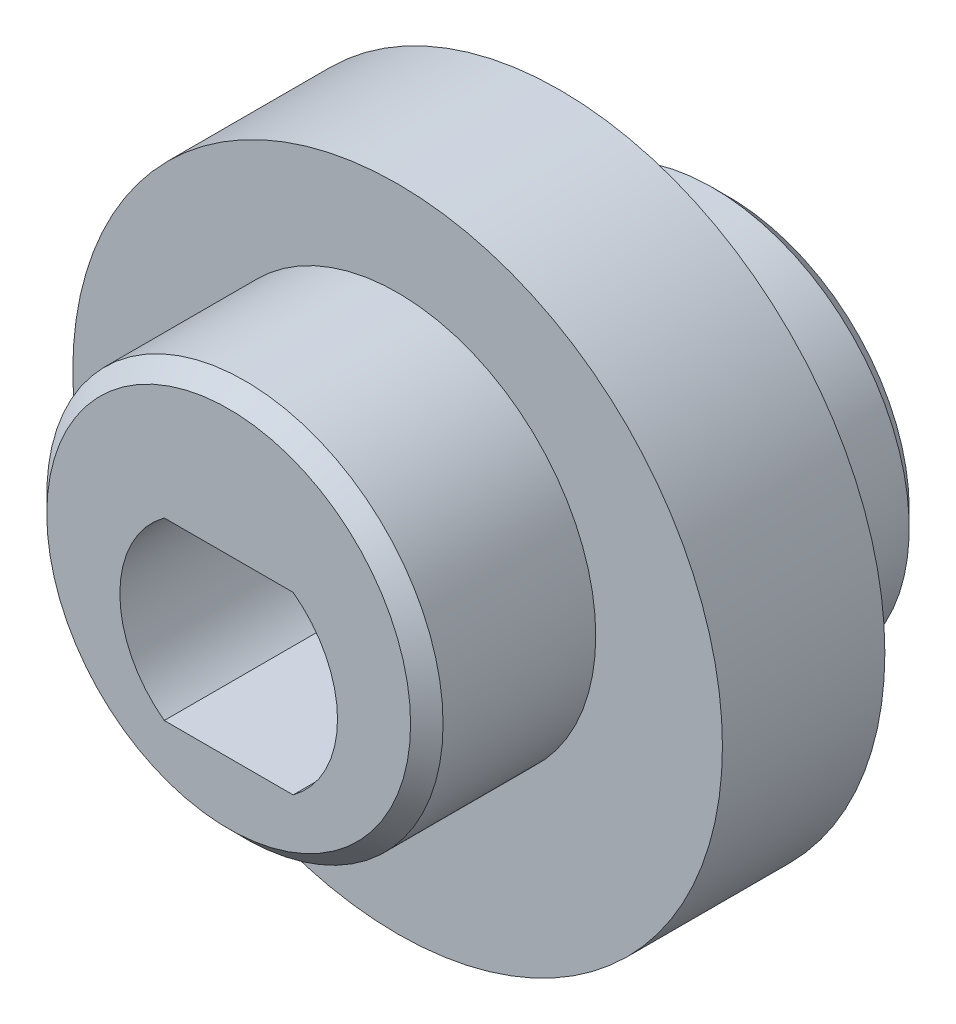
ISO-10303-21;
HEADER;
FILE_DESCRIPTION(('STEP AP214'),'2;1');
FILE_NAME('part.step','',(''),(''),'','','');
FILE_SCHEMA(('AUTOMOTIVE_DESIGN { 1 0 10303 214 1 1 1 1 }'));
ENDSEC;
DATA;
#1=APPLICATION_CONTEXT('core data for automotive mechanical design processes');
#2=APPLICATION_PROTOCOL_DEFINITION('international standard','automotive_design',2000,#1);
#3=PRODUCT_CONTEXT('',#1,'mechanical');
#4=PRODUCT('Part','Part','',(#3));
#5=PRODUCT_RELATED_PRODUCT_CATEGORY('part','',(#4));
#6=PRODUCT_DEFINITION_FORMATION('','',#4);
#7=PRODUCT_DEFINITION_CONTEXT('part definition',#1,'design');
#8=PRODUCT_DEFINITION('design','',#6,#7);
#9=PRODUCT_DEFINITION_SHAPE('','',#8);
#10=(LENGTH_UNIT() NAMED_UNIT(*) SI_UNIT(.MILLI.,.METRE.));
#11=(NAMED_UNIT(*) PLANE_ANGLE_UNIT() SI_UNIT($,.RADIAN.));
#12=(NAMED_UNIT(*) SI_UNIT($,.STERADIAN.) SOLID_ANGLE_UNIT());
#13=UNCERTAINTY_MEASURE_WITH_UNIT(LENGTH_MEASURE(1.E-05),#10,'distance_accuracy_value','');
#14=(GEOMETRIC_REPRESENTATION_CONTEXT(3) GLOBAL_UNCERTAINTY_ASSIGNED_CONTEXT((#13)) GLOBAL_UNIT_ASSIGNED_CONTEXT((#10,
#11,#12)) REPRESENTATION_CONTEXT('',''));
#15=CARTESIAN_POINT('',(0.,0.,0.));
#16=DIRECTION('',(0.,0.,1.));
#17=DIRECTION('',(1.,0.,0.));
#18=AXIS2_PLACEMENT_3D('',#15,#16,#17);
#19=CARTESIAN_POINT('',(0.,0.,2.5));
#20=DIRECTION('',(0.,0.,1.));
#21=DIRECTION('',(1.,0.,0.));
#22=AXIS2_PLACEMENT_3D('',#19,#20,#21);
#23=PLANE('',#22);
#24=CARTESIAN_POINT('',(0.,1.,2.5));
#25=DIRECTION('',(0.,0.,1.));
#26=DIRECTION('',(1.,0.,0.));
#27=AXIS2_PLACEMENT_3D('',#24,#25,#26);
#28=CIRCLE('',#27,6.1);
#29=CARTESIAN_POINT('',(6.1,1.,2.5));
#30=VERTEX_POINT('',#29);
#31=EDGE_CURVE('E148',#30,#30,#28,.T.);
#32=ORIENTED_EDGE('',*,*,#31,.F.);
#33=EDGE_LOOP('',(#32));
#34=FACE_BOUND('',#33,.T.);
#35=CARTESIAN_POINT('',(0.,0.,2.5));
#36=DIRECTION('',(0.,0.,1.));
#37=DIRECTION('',(1.,0.,0.));
#38=AXIS2_PLACEMENT_3D('',#35,#36,#37);
#39=CIRCLE('',#38,10.);
#40=CARTESIAN_POINT('',(10.,0.,2.5));
#41=VERTEX_POINT('',#40);
#42=EDGE_CURVE('E132',#41,#41,#39,.T.);
#43=ORIENTED_EDGE('',*,*,#42,.T.);
#44=EDGE_LOOP('',(#43));
#45=FACE_BOUND('',#44,.T.);
#46=ADVANCED_FACE('F47',(#34,#45),#23,.T.);
#47=CARTESIAN_POINT('',(0.,1.,7.7));
#48=DIRECTION('',(0.,0.,-1.));
#49=DIRECTION('',(-1.,0.,0.));
#50=AXIS2_PLACEMENT_3D('',#47,#48,#49);
#51=CYLINDRICAL_SURFACE('',#50,6.1);
#52=CARTESIAN_POINT('',(0.,1.,7.2));
#53=DIRECTION('',(0.,0.,1.));
#54=DIRECTION('',(1.,0.,0.));
#55=AXIS2_PLACEMENT_3D('',#52,#53,#54);
#56=CIRCLE('',#55,6.1);
#57=CARTESIAN_POINT('',(6.1,1.,7.2));
#58=VERTEX_POINT('',#57);
#59=EDGE_CURVE('E11',#58,#58,#56,.F.);
#60=ORIENTED_EDGE('',*,*,#59,.T.);
#61=EDGE_LOOP('',(#60));
#62=FACE_BOUND('',#61,.T.);
#63=ORIENTED_EDGE('',*,*,#31,.T.);
#64=EDGE_LOOP('',(#63));
#65=FACE_BOUND('',#64,.T.);
#66=ADVANCED_FACE('F173',(#62,#65),#51,.T.);
#67=CARTESIAN_POINT('',(0.,1.,7.7));
#68=DIRECTION('',(0.,0.,1.));
#69=DIRECTION('',(1.,0.,0.));
#70=AXIS2_PLACEMENT_3D('',#67,#68,#69);
#71=PLANE('',#70);
#72=CARTESIAN_POINT('',(0.,1.,7.7));
#73=DIRECTION('',(0.,0.,1.));
#74=DIRECTION('',(1.,0.,0.));
#75=AXIS2_PLACEMENT_3D('',#72,#73,#74);
#76=CIRCLE('',#75,5.6);
#77=CARTESIAN_POINT('',(5.6,1.,7.7));
#78=VERTEX_POINT('',#77);
#79=EDGE_CURVE('E57',#78,#78,#76,.T.);
#80=ORIENTED_EDGE('',*,*,#79,.T.);
#81=EDGE_LOOP('',(#80));
#82=FACE_BOUND('',#81,.T.);
#83=CARTESIAN_POINT('',(0.,0.,7.7));
#84=DIRECTION('',(0.,0.,1.));
#85=DIRECTION('',(1.,0.,0.));
#86=AXIS2_PLACEMENT_3D('',#83,#84,#85);
#87=CIRCLE('',#86,3.35);
#88=CARTESIAN_POINT('',(-1.98305320150519,2.7,7.7));
#89=VERTEX_POINT('',#88);
#90=CARTESIAN_POINT('',(-1.98305320150519,-2.7,7.7));
#91=VERTEX_POINT('',#90);
#92=EDGE_CURVE('E64',#89,#91,#87,.T.);
#93=ORIENTED_EDGE('',*,*,#92,.F.);
#94=DIRECTION('',(-1.,0.,0.));
#95=VECTOR('',#94,1.);
#96=CARTESIAN_POINT('',(-1.98305320150519,2.7,7.7));
#97=LINE('',#96,#95);
#98=CARTESIAN_POINT('',(1.98305320150519,2.7,7.7));
#99=VERTEX_POINT('',#98);
#100=EDGE_CURVE('E109',#99,#89,#97,.T.);
#101=ORIENTED_EDGE('',*,*,#100,.F.);
#102=CARTESIAN_POINT('',(0.,0.,7.7));
#103=DIRECTION('',(0.,0.,1.));
#104=DIRECTION('',(1.,0.,0.));
#105=AXIS2_PLACEMENT_3D('',#102,#103,#104);
#106=CIRCLE('',#105,3.35);
#107=CARTESIAN_POINT('',(1.98305320150519,-2.7,7.7));
#108=VERTEX_POINT('',#107);
#109=EDGE_CURVE('E92',#108,#99,#106,.T.);
#110=ORIENTED_EDGE('',*,*,#109,.F.);
#111=DIRECTION('',(1.,0.,0.));
#112=VECTOR('',#111,1.);
#113=CARTESIAN_POINT('',(-1.98305320150519,-2.7,7.7));
#114=LINE('',#113,#112);
#115=EDGE_CURVE('E102',#91,#108,#114,.T.);
#116=ORIENTED_EDGE('',*,*,#115,.F.);
#117=EDGE_LOOP('',(#93,#101,#110,#116));
#118=FACE_BOUND('',#117,.T.);
#119=ADVANCED_FACE('F107',(#82,#118),#71,.T.);
#120=CARTESIAN_POINT('',(0.,0.,-30.7842712474619));
#121=DIRECTION('',(0.,0.,1.));
#122=DIRECTION('',(1.,0.,0.));
#123=AXIS2_PLACEMENT_3D('',#120,#121,#122);
#124=CYLINDRICAL_SURFACE('',#123,10.);
#125=CARTESIAN_POINT('',(0.,0.,-2.5));
#126=DIRECTION('',(0.,0.,1.));
#127=DIRECTION('',(1.,0.,0.));
#128=AXIS2_PLACEMENT_3D('',#125,#126,#127);
#129=CIRCLE('',#128,10.);
#130=CARTESIAN_POINT('',(10.,0.,-2.5));
#131=VERTEX_POINT('',#130);
#132=EDGE_CURVE('E140',#131,#131,#129,.F.);
#133=ORIENTED_EDGE('',*,*,#132,.F.);
#134=EDGE_LOOP('',(#133));
#135=FACE_BOUND('',#134,.T.);
#136=ORIENTED_EDGE('',*,*,#42,.F.);
#137=EDGE_LOOP('',(#136));
#138=FACE_BOUND('',#137,.T.);
#139=ADVANCED_FACE('F209',(#135,#138),#124,.T.);
#140=CARTESIAN_POINT('',(0.,-1.,-7.7));
#141=DIRECTION('',(0.,0.,-1.));
#142=DIRECTION('',(-1.,0.,0.));
#143=AXIS2_PLACEMENT_3D('',#140,#141,#142);
#144=PLANE('',#143);
#145=CARTESIAN_POINT('',(0.,-1.,-7.7));
#146=DIRECTION('',(0.,0.,-1.));
#147=DIRECTION('',(-1.,0.,0.));
#148=AXIS2_PLACEMENT_3D('',#145,#146,#147);
#149=CIRCLE('',#148,5.55);
#150=CARTESIAN_POINT('',(-5.55,-1.,-7.7));
#151=VERTEX_POINT('',#150);
#152=EDGE_CURVE('E152',#151,#151,#149,.T.);
#153=ORIENTED_EDGE('',*,*,#152,.T.);
#154=EDGE_LOOP('',(#153));
#155=FACE_BOUND('',#154,.T.);
#156=CARTESIAN_POINT('',(0.,0.,-7.7));
#157=DIRECTION('',(0.,0.,1.));
#158=DIRECTION('',(1.,0.,0.));
#159=AXIS2_PLACEMENT_3D('',#156,#157,#158);
#160=CIRCLE('',#159,3.35);
#161=CARTESIAN_POINT('',(-1.98305320150519,2.7,-7.7));
#162=VERTEX_POINT('',#161);
#163=CARTESIAN_POINT('',(-1.98305320150519,-2.7,-7.7));
#164=VERTEX_POINT('',#163);
#165=EDGE_CURVE('E113',#162,#164,#160,.T.);
#166=ORIENTED_EDGE('',*,*,#165,.T.);
#167=DIRECTION('',(1.,0.,0.));
#168=VECTOR('',#167,1.);
#169=CARTESIAN_POINT('',(-1.98305320150519,-2.7,-7.7));
#170=LINE('',#169,#168);
#171=CARTESIAN_POINT('',(1.98305320150519,-2.7,-7.7));
#172=VERTEX_POINT('',#171);
#173=EDGE_CURVE('E120',#164,#172,#170,.T.);
#174=ORIENTED_EDGE('',*,*,#173,.T.);
#175=CARTESIAN_POINT('',(0.,0.,-7.7));
#176=DIRECTION('',(0.,0.,1.));
#177=DIRECTION('',(1.,0.,0.));
#178=AXIS2_PLACEMENT_3D('',#175,#176,#177);
#179=CIRCLE('',#178,3.35);
#180=CARTESIAN_POINT('',(1.98305320150519,2.7,-7.7));
#181=VERTEX_POINT('',#180);
#182=EDGE_CURVE('E72',#172,#181,#179,.T.);
#183=ORIENTED_EDGE('',*,*,#182,.T.);
#184=DIRECTION('',(-1.,0.,0.));
#185=VECTOR('',#184,1.);
#186=CARTESIAN_POINT('',(-1.98305320150519,2.7,-7.7));
#187=LINE('',#186,#185);
#188=EDGE_CURVE('E125',#181,#162,#187,.T.);
#189=ORIENTED_EDGE('',*,*,#188,.T.);
#190=EDGE_LOOP('',(#166,#174,#183,#189));
#191=FACE_BOUND('',#190,.T.);
#192=ADVANCED_FACE('F202',(#155,#191),#144,.T.);
#193=CARTESIAN_POINT('',(0.,-1.,-7.7));
#194=DIRECTION('',(0.,0.,1.));
#195=DIRECTION('',(1.,0.,0.));
#196=AXIS2_PLACEMENT_3D('',#193,#194,#195);
#197=CYLINDRICAL_SURFACE('',#196,6.05);
#198=CARTESIAN_POINT('',(0.,-1.,-7.2));
#199=DIRECTION('',(0.,0.,-1.));
#200=DIRECTION('',(-1.,0.,0.));
#201=AXIS2_PLACEMENT_3D('',#198,#199,#200);
#202=CIRCLE('',#201,6.05);
#203=CARTESIAN_POINT('',(-6.05,-1.,-7.2));
#204=VERTEX_POINT('',#203);
#205=EDGE_CURVE('E156',#204,#204,#202,.F.);
#206=ORIENTED_EDGE('',*,*,#205,.T.);
#207=EDGE_LOOP('',(#206));
#208=FACE_BOUND('',#207,.T.);
#209=CARTESIAN_POINT('',(0.,-1.,-2.5));
#210=DIRECTION('',(0.,0.,-1.));
#211=DIRECTION('',(-1.,0.,0.));
#212=AXIS2_PLACEMENT_3D('',#209,#210,#211);
#213=CIRCLE('',#212,6.05);
#214=CARTESIAN_POINT('',(-6.05,-1.,-2.5));
#215=VERTEX_POINT('',#214);
#216=EDGE_CURVE('E144',#215,#215,#213,.T.);
#217=ORIENTED_EDGE('',*,*,#216,.T.);
#218=EDGE_LOOP('',(#217));
#219=FACE_BOUND('',#218,.T.);
#220=ADVANCED_FACE('F189',(#208,#219),#197,.T.);
#221=CARTESIAN_POINT('',(0.,0.,-2.5));
#222=DIRECTION('',(0.,0.,1.));
#223=DIRECTION('',(1.,0.,0.));
#224=AXIS2_PLACEMENT_3D('',#221,#222,#223);
#225=PLANE('',#224);
#226=ORIENTED_EDGE('',*,*,#216,.F.);
#227=EDGE_LOOP('',(#226));
#228=FACE_BOUND('',#227,.T.);
#229=ORIENTED_EDGE('',*,*,#132,.T.);
#230=EDGE_LOOP('',(#229));
#231=FACE_BOUND('',#230,.T.);
#232=ADVANCED_FACE('F186',(#228,#231),#225,.F.);
#233=CARTESIAN_POINT('',(0.,0.,-7.7));
#234=DIRECTION('',(0.,0.,1.));
#235=DIRECTION('',(1.,0.,0.));
#236=AXIS2_PLACEMENT_3D('',#233,#234,#235);
#237=CYLINDRICAL_SURFACE('',#236,3.35);
#238=DIRECTION('',(0.,0.,1.));
#239=VECTOR('',#238,1.);
#240=CARTESIAN_POINT('',(-1.98305320150519,-2.7,-7.7));
#241=LINE('',#240,#239);
#242=EDGE_CURVE('E99',#164,#91,#241,.T.);
#243=ORIENTED_EDGE('',*,*,#242,.F.);
#244=ORIENTED_EDGE('',*,*,#165,.F.);
#245=DIRECTION('',(0.,0.,1.));
#246=VECTOR('',#245,1.);
#247=CARTESIAN_POINT('',(-1.98305320150519,2.7,-7.7));
#248=LINE('',#247,#246);
#249=EDGE_CURVE('E129',#162,#89,#248,.T.);
#250=ORIENTED_EDGE('',*,*,#249,.T.);
#251=ORIENTED_EDGE('',*,*,#92,.T.);
#252=EDGE_LOOP('',(#243,#244,#250,#251));
#253=FACE_BOUND('',#252,.T.);
#254=ADVANCED_FACE('F188',(#253),#237,.F.);
#255=CARTESIAN_POINT('',(-1.98305320150519,2.7,-7.7));
#256=DIRECTION('',(0.,1.,0.));
#257=DIRECTION('',(-1.,0.,0.));
#258=AXIS2_PLACEMENT_3D('',#255,#256,#257);
#259=PLANE('',#258);
#260=ORIENTED_EDGE('',*,*,#249,.F.);
#261=ORIENTED_EDGE('',*,*,#188,.F.);
#262=DIRECTION('',(0.,0.,1.));
#263=VECTOR('',#262,1.);
#264=CARTESIAN_POINT('',(1.98305320150519,2.7,-7.7));
#265=LINE('',#264,#263);
#266=EDGE_CURVE('E98',#181,#99,#265,.T.);
#267=ORIENTED_EDGE('',*,*,#266,.T.);
#268=ORIENTED_EDGE('',*,*,#100,.T.);
#269=EDGE_LOOP('',(#260,#261,#267,#268));
#270=FACE_BOUND('',#269,.T.);
#271=ADVANCED_FACE('F199',(#270),#259,.F.);
#272=CARTESIAN_POINT('',(0.,0.,-7.7));
#273=DIRECTION('',(0.,0.,1.));
#274=DIRECTION('',(1.,0.,0.));
#275=AXIS2_PLACEMENT_3D('',#272,#273,#274);
#276=CYLINDRICAL_SURFACE('',#275,3.35);
#277=ORIENTED_EDGE('',*,*,#266,.F.);
#278=ORIENTED_EDGE('',*,*,#182,.F.);
#279=DIRECTION('',(0.,0.,1.));
#280=VECTOR('',#279,1.);
#281=CARTESIAN_POINT('',(1.98305320150519,-2.7,-7.7));
#282=LINE('',#281,#280);
#283=EDGE_CURVE('E88',#172,#108,#282,.T.);
#284=ORIENTED_EDGE('',*,*,#283,.T.);
#285=ORIENTED_EDGE('',*,*,#109,.T.);
#286=EDGE_LOOP('',(#277,#278,#284,#285));
#287=FACE_BOUND('',#286,.T.);
#288=ADVANCED_FACE('F90',(#287),#276,.F.);
#289=CARTESIAN_POINT('',(-1.98305320150519,-2.7,-7.7));
#290=DIRECTION('',(0.,-1.,0.));
#291=DIRECTION('',(0.,0.,-1.));
#292=AXIS2_PLACEMENT_3D('',#289,#290,#291);
#293=PLANE('',#292);
#294=ORIENTED_EDGE('',*,*,#283,.F.);
#295=ORIENTED_EDGE('',*,*,#173,.F.);
#296=ORIENTED_EDGE('',*,*,#242,.T.);
#297=ORIENTED_EDGE('',*,*,#115,.T.);
#298=EDGE_LOOP('',(#294,#295,#296,#297));
#299=FACE_BOUND('',#298,.T.);
#300=ADVANCED_FACE('F103',(#299),#293,.F.);
#301=CARTESIAN_POINT('',(0.,-1.,-7.7));
#302=DIRECTION('',(0.,0.,1.));
#303=DIRECTION('',(1.,0.,0.));
#304=AXIS2_PLACEMENT_3D('',#301,#302,#303);
#305=CONICAL_SURFACE('',#304,5.55,0.785398163397445);
#306=ORIENTED_EDGE('',*,*,#205,.F.);
#307=EDGE_LOOP('',(#306));
#308=FACE_BOUND('',#307,.T.);
#309=ORIENTED_EDGE('',*,*,#152,.F.);
#310=EDGE_LOOP('',(#309));
#311=FACE_BOUND('',#310,.T.);
#312=ADVANCED_FACE('F165',(#308,#311),#305,.T.);
#313=CARTESIAN_POINT('',(0.,1.,7.7));
#314=DIRECTION('',(0.,0.,-1.));
#315=DIRECTION('',(-1.,0.,0.));
#316=AXIS2_PLACEMENT_3D('',#313,#314,#315);
#317=CONICAL_SURFACE('',#316,5.6,0.785398163397448);
#318=ORIENTED_EDGE('',*,*,#59,.F.);
#319=EDGE_LOOP('',(#318));
#320=FACE_BOUND('',#319,.T.);
#321=ORIENTED_EDGE('',*,*,#79,.F.);
#322=EDGE_LOOP('',(#321));
#323=FACE_BOUND('',#322,.T.);
#324=ADVANCED_FACE('F50',(#320,#323),#317,.T.);
#325=CLOSED_SHELL('',(#46,#66,#119,#139,#192,#220,#232,#254,#271,#288,#300,#312,#324));
#326=MANIFOLD_SOLID_BREP('B2',#325);
#327=ADVANCED_BREP_SHAPE_REPRESENTATION('',(#18,#326),#14);
#328=SHAPE_DEFINITION_REPRESENTATION(#9,#327);
ENDSEC;
END-ISO-10303-21;
